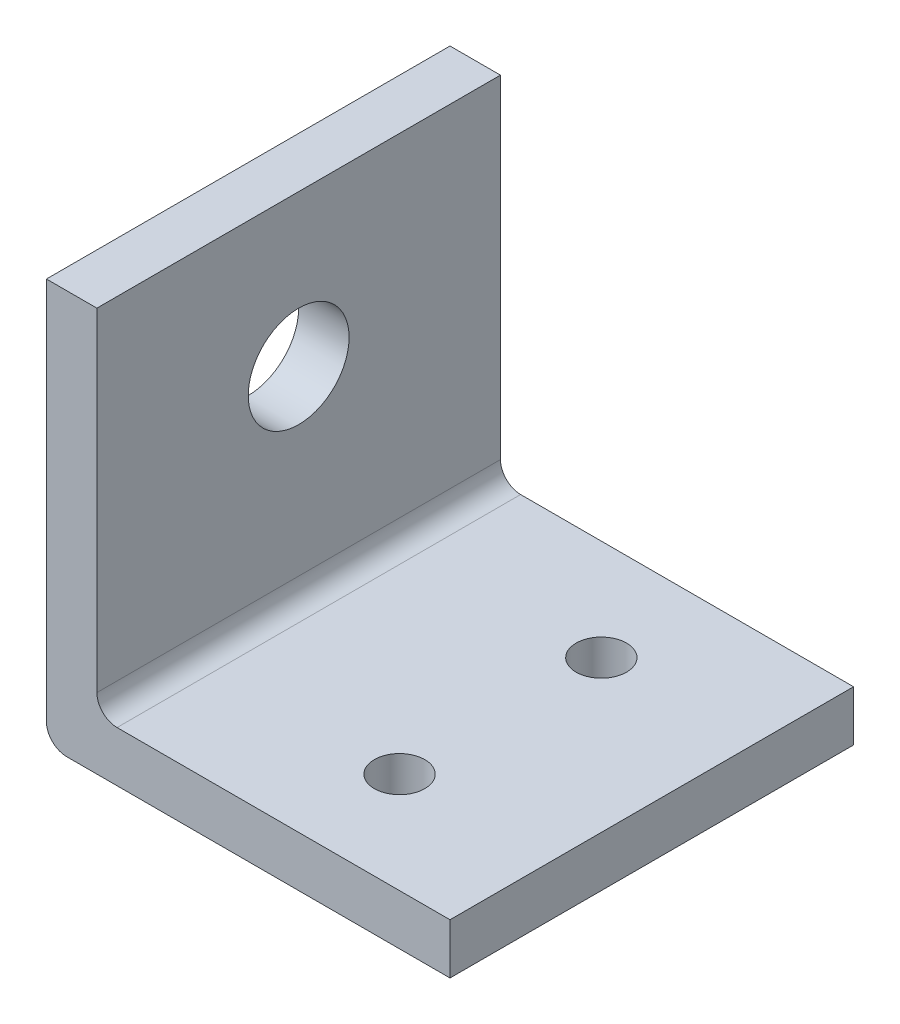
ISO-10303-21;
HEADER;
FILE_DESCRIPTION(('STEP AP214'),'2;1');
FILE_NAME('part.step','',(''),(''),'','','');
FILE_SCHEMA(('AUTOMOTIVE_DESIGN { 1 0 10303 214 1 1 1 1 }'));
ENDSEC;
DATA;
#1=APPLICATION_CONTEXT('core data for automotive mechanical design processes');
#2=APPLICATION_PROTOCOL_DEFINITION('international standard','automotive_design',2000,#1);
#3=PRODUCT_CONTEXT('',#1,'mechanical');
#4=PRODUCT('Part','Part','',(#3));
#5=PRODUCT_RELATED_PRODUCT_CATEGORY('part','',(#4));
#6=PRODUCT_DEFINITION_FORMATION('','',#4);
#7=PRODUCT_DEFINITION_CONTEXT('part definition',#1,'design');
#8=PRODUCT_DEFINITION('design','',#6,#7);
#9=PRODUCT_DEFINITION_SHAPE('','',#8);
#10=(LENGTH_UNIT() NAMED_UNIT(*) SI_UNIT(.MILLI.,.METRE.));
#11=(NAMED_UNIT(*) PLANE_ANGLE_UNIT() SI_UNIT($,.RADIAN.));
#12=(NAMED_UNIT(*) SI_UNIT($,.STERADIAN.) SOLID_ANGLE_UNIT());
#13=UNCERTAINTY_MEASURE_WITH_UNIT(LENGTH_MEASURE(1.E-05),#10,'distance_accuracy_value','');
#14=(GEOMETRIC_REPRESENTATION_CONTEXT(3) GLOBAL_UNCERTAINTY_ASSIGNED_CONTEXT((#13)) GLOBAL_UNIT_ASSIGNED_CONTEXT((#10,
#11,#12)) REPRESENTATION_CONTEXT('',''));
#15=CARTESIAN_POINT('',(0.,0.,0.));
#16=DIRECTION('',(0.,0.,1.));
#17=DIRECTION('',(1.,0.,0.));
#18=AXIS2_PLACEMENT_3D('',#15,#16,#17);
#19=CARTESIAN_POINT('',(0.,40.,40.));
#20=DIRECTION('',(0.,-1.,0.));
#21=DIRECTION('',(0.,0.,-1.));
#22=AXIS2_PLACEMENT_3D('',#19,#20,#21);
#23=PLANE('',#22);
#24=DIRECTION('',(-1.,0.,0.));
#25=VECTOR('',#24,1.);
#26=CARTESIAN_POINT('',(0.,40.,0.));
#27=LINE('',#26,#25);
#28=CARTESIAN_POINT('',(5.,40.,0.));
#29=VERTEX_POINT('',#28);
#30=CARTESIAN_POINT('',(0.,40.,0.));
#31=VERTEX_POINT('',#30);
#32=EDGE_CURVE('E143',#29,#31,#27,.T.);
#33=ORIENTED_EDGE('',*,*,#32,.T.);
#34=DIRECTION('',(0.,0.,-1.));
#35=VECTOR('',#34,1.);
#36=CARTESIAN_POINT('',(0.,40.,40.));
#37=LINE('',#36,#35);
#38=CARTESIAN_POINT('',(0.,40.,40.));
#39=VERTEX_POINT('',#38);
#40=EDGE_CURVE('E11',#39,#31,#37,.T.);
#41=ORIENTED_EDGE('',*,*,#40,.F.);
#42=DIRECTION('',(-1.,0.,0.));
#43=VECTOR('',#42,1.);
#44=CARTESIAN_POINT('',(0.,40.,40.));
#45=LINE('',#44,#43);
#46=CARTESIAN_POINT('',(5.,40.,40.));
#47=VERTEX_POINT('',#46);
#48=EDGE_CURVE('E166',#47,#39,#45,.T.);
#49=ORIENTED_EDGE('',*,*,#48,.F.);
#50=DIRECTION('',(0.,0.,-1.));
#51=VECTOR('',#50,1.);
#52=CARTESIAN_POINT('',(5.,40.,40.));
#53=LINE('',#52,#51);
#54=EDGE_CURVE('E139',#47,#29,#53,.T.);
#55=ORIENTED_EDGE('',*,*,#54,.T.);
#56=EDGE_LOOP('',(#33,#41,#49,#55));
#57=FACE_BOUND('',#56,.T.);
#58=ADVANCED_FACE('F42',(#57),#23,.F.);
#59=CARTESIAN_POINT('',(0.,2.00000000000001,40.));
#60=DIRECTION('',(1.,0.,0.));
#61=DIRECTION('',(0.,0.,-1.));
#62=AXIS2_PLACEMENT_3D('',#59,#60,#61);
#63=PLANE('',#62);
#64=CARTESIAN_POINT('',(0.,25.,20.));
#65=DIRECTION('',(1.,0.,0.));
#66=DIRECTION('',(0.,0.,-1.));
#67=AXIS2_PLACEMENT_3D('',#64,#65,#66);
#68=CIRCLE('',#67,5.);
#69=CARTESIAN_POINT('',(0.,25.,15.));
#70=VERTEX_POINT('',#69);
#71=EDGE_CURVE('E148',#70,#70,#68,.T.);
#72=ORIENTED_EDGE('',*,*,#71,.T.);
#73=EDGE_LOOP('',(#72));
#74=FACE_BOUND('',#73,.T.);
#75=DIRECTION('',(0.,-1.,0.));
#76=VECTOR('',#75,1.);
#77=CARTESIAN_POINT('',(0.,2.00000000000001,0.));
#78=LINE('',#77,#76);
#79=CARTESIAN_POINT('',(0.,2.00000000000001,0.));
#80=VERTEX_POINT('',#79);
#81=EDGE_CURVE('E147',#31,#80,#78,.T.);
#82=ORIENTED_EDGE('',*,*,#81,.T.);
#83=DIRECTION('',(0.,0.,-1.));
#84=VECTOR('',#83,1.);
#85=CARTESIAN_POINT('',(0.,2.00000000000001,40.));
#86=LINE('',#85,#84);
#87=CARTESIAN_POINT('',(0.,2.00000000000001,40.));
#88=VERTEX_POINT('',#87);
#89=EDGE_CURVE('E51',#88,#80,#86,.T.);
#90=ORIENTED_EDGE('',*,*,#89,.F.);
#91=DIRECTION('',(0.,-1.,0.));
#92=VECTOR('',#91,1.);
#93=CARTESIAN_POINT('',(0.,2.00000000000001,40.));
#94=LINE('',#93,#92);
#95=EDGE_CURVE('E102',#39,#88,#94,.T.);
#96=ORIENTED_EDGE('',*,*,#95,.F.);
#97=ORIENTED_EDGE('',*,*,#40,.T.);
#98=EDGE_LOOP('',(#82,#90,#96,#97));
#99=FACE_BOUND('',#98,.T.);
#100=ADVANCED_FACE('F258',(#74,#99),#63,.F.);
#101=CARTESIAN_POINT('',(2.,2.,40.));
#102=DIRECTION('',(0.,0.,-1.));
#103=DIRECTION('',(-1.,0.,0.));
#104=AXIS2_PLACEMENT_3D('',#101,#102,#103);
#105=CYLINDRICAL_SURFACE('',#104,2.);
#106=CARTESIAN_POINT('',(2.,2.,0.));
#107=DIRECTION('',(0.,0.,1.));
#108=DIRECTION('',(-1.,0.,0.));
#109=AXIS2_PLACEMENT_3D('',#106,#107,#108);
#110=CIRCLE('',#109,2.);
#111=CARTESIAN_POINT('',(2.00000000000001,0.,0.));
#112=VERTEX_POINT('',#111);
#113=EDGE_CURVE('E151',#80,#112,#110,.T.);
#114=ORIENTED_EDGE('',*,*,#113,.T.);
#115=DIRECTION('',(0.,0.,-1.));
#116=VECTOR('',#115,1.);
#117=CARTESIAN_POINT('',(2.00000000000001,0.,40.));
#118=LINE('',#117,#116);
#119=CARTESIAN_POINT('',(2.00000000000001,0.,40.));
#120=VERTEX_POINT('',#119);
#121=EDGE_CURVE('E177',#120,#112,#118,.T.);
#122=ORIENTED_EDGE('',*,*,#121,.F.);
#123=CARTESIAN_POINT('',(2.,2.,40.));
#124=DIRECTION('',(0.,0.,1.));
#125=DIRECTION('',(-1.,0.,0.));
#126=AXIS2_PLACEMENT_3D('',#123,#124,#125);
#127=CIRCLE('',#126,2.);
#128=EDGE_CURVE('E187',#88,#120,#127,.T.);
#129=ORIENTED_EDGE('',*,*,#128,.F.);
#130=ORIENTED_EDGE('',*,*,#89,.T.);
#131=EDGE_LOOP('',(#114,#122,#129,#130));
#132=FACE_BOUND('',#131,.T.);
#133=ADVANCED_FACE('F185',(#132),#105,.T.);
#134=CARTESIAN_POINT('',(2.00000000000001,0.,40.));
#135=DIRECTION('',(0.,1.,0.));
#136=DIRECTION('',(0.,0.,1.));
#137=AXIS2_PLACEMENT_3D('',#134,#135,#136);
#138=PLANE('',#137);
#139=CARTESIAN_POINT('',(25.,0.,10.));
#140=DIRECTION('',(0.,1.,0.));
#141=DIRECTION('',(0.,0.,1.));
#142=AXIS2_PLACEMENT_3D('',#139,#140,#141);
#143=CIRCLE('',#142,2.5);
#144=CARTESIAN_POINT('',(25.,0.,12.5));
#145=VERTEX_POINT('',#144);
#146=EDGE_CURVE('E217',#145,#145,#143,.T.);
#147=ORIENTED_EDGE('',*,*,#146,.T.);
#148=EDGE_LOOP('',(#147));
#149=FACE_BOUND('',#148,.T.);
#150=CARTESIAN_POINT('',(25.,0.,30.));
#151=DIRECTION('',(0.,1.,0.));
#152=DIRECTION('',(0.,0.,1.));
#153=AXIS2_PLACEMENT_3D('',#150,#151,#152);
#154=CIRCLE('',#153,2.5);
#155=CARTESIAN_POINT('',(25.,0.,32.5));
#156=VERTEX_POINT('',#155);
#157=EDGE_CURVE('E221',#156,#156,#154,.T.);
#158=ORIENTED_EDGE('',*,*,#157,.T.);
#159=EDGE_LOOP('',(#158));
#160=FACE_BOUND('',#159,.T.);
#161=DIRECTION('',(1.,0.,0.));
#162=VECTOR('',#161,1.);
#163=CARTESIAN_POINT('',(2.00000000000001,0.,0.));
#164=LINE('',#163,#162);
#165=CARTESIAN_POINT('',(40.,0.,0.));
#166=VERTEX_POINT('',#165);
#167=EDGE_CURVE('E154',#112,#166,#164,.T.);
#168=ORIENTED_EDGE('',*,*,#167,.T.);
#169=DIRECTION('',(0.,0.,-1.));
#170=VECTOR('',#169,1.);
#171=CARTESIAN_POINT('',(40.,0.,40.));
#172=LINE('',#171,#170);
#173=CARTESIAN_POINT('',(40.,0.,40.));
#174=VERTEX_POINT('',#173);
#175=EDGE_CURVE('E173',#174,#166,#172,.T.);
#176=ORIENTED_EDGE('',*,*,#175,.F.);
#177=DIRECTION('',(1.,0.,0.));
#178=VECTOR('',#177,1.);
#179=CARTESIAN_POINT('',(2.00000000000001,0.,40.));
#180=LINE('',#179,#178);
#181=EDGE_CURVE('E200',#120,#174,#180,.T.);
#182=ORIENTED_EDGE('',*,*,#181,.F.);
#183=ORIENTED_EDGE('',*,*,#121,.T.);
#184=EDGE_LOOP('',(#168,#176,#182,#183));
#185=FACE_BOUND('',#184,.T.);
#186=ADVANCED_FACE('F195',(#149,#160,#185),#138,.F.);
#187=CARTESIAN_POINT('',(40.,5.,40.));
#188=DIRECTION('',(-1.,0.,0.));
#189=DIRECTION('',(0.,0.,1.));
#190=AXIS2_PLACEMENT_3D('',#187,#188,#189);
#191=PLANE('',#190);
#192=DIRECTION('',(0.,1.,0.));
#193=VECTOR('',#192,1.);
#194=CARTESIAN_POINT('',(40.,5.,0.));
#195=LINE('',#194,#193);
#196=CARTESIAN_POINT('',(40.,5.,0.));
#197=VERTEX_POINT('',#196);
#198=EDGE_CURVE('E157',#166,#197,#195,.T.);
#199=ORIENTED_EDGE('',*,*,#198,.T.);
#200=DIRECTION('',(0.,0.,-1.));
#201=VECTOR('',#200,1.);
#202=CARTESIAN_POINT('',(40.,5.,40.));
#203=LINE('',#202,#201);
#204=CARTESIAN_POINT('',(40.,5.,40.));
#205=VERTEX_POINT('',#204);
#206=EDGE_CURVE('E132',#205,#197,#203,.T.);
#207=ORIENTED_EDGE('',*,*,#206,.F.);
#208=DIRECTION('',(0.,1.,0.));
#209=VECTOR('',#208,1.);
#210=CARTESIAN_POINT('',(40.,5.,40.));
#211=LINE('',#210,#209);
#212=EDGE_CURVE('E121',#174,#205,#211,.T.);
#213=ORIENTED_EDGE('',*,*,#212,.F.);
#214=ORIENTED_EDGE('',*,*,#175,.T.);
#215=EDGE_LOOP('',(#199,#207,#213,#214));
#216=FACE_BOUND('',#215,.T.);
#217=ADVANCED_FACE('F198',(#216),#191,.F.);
#218=CARTESIAN_POINT('',(7.00000000000002,5.,40.));
#219=DIRECTION('',(0.,-1.,0.));
#220=DIRECTION('',(0.,0.,-1.));
#221=AXIS2_PLACEMENT_3D('',#218,#219,#220);
#222=PLANE('',#221);
#223=CARTESIAN_POINT('',(25.,5.,10.));
#224=DIRECTION('',(0.,1.,0.));
#225=DIRECTION('',(0.,0.,1.));
#226=AXIS2_PLACEMENT_3D('',#223,#224,#225);
#227=CIRCLE('',#226,2.5);
#228=CARTESIAN_POINT('',(25.,5.,12.5));
#229=VERTEX_POINT('',#228);
#230=EDGE_CURVE('E225',#229,#229,#227,.T.);
#231=ORIENTED_EDGE('',*,*,#230,.F.);
#232=EDGE_LOOP('',(#231));
#233=FACE_BOUND('',#232,.T.);
#234=CARTESIAN_POINT('',(25.,5.,30.));
#235=DIRECTION('',(0.,1.,0.));
#236=DIRECTION('',(0.,0.,1.));
#237=AXIS2_PLACEMENT_3D('',#234,#235,#236);
#238=CIRCLE('',#237,2.5);
#239=CARTESIAN_POINT('',(25.,5.,32.5));
#240=VERTEX_POINT('',#239);
#241=EDGE_CURVE('E226',#240,#240,#238,.T.);
#242=ORIENTED_EDGE('',*,*,#241,.F.);
#243=EDGE_LOOP('',(#242));
#244=FACE_BOUND('',#243,.T.);
#245=DIRECTION('',(-1.,0.,0.));
#246=VECTOR('',#245,1.);
#247=CARTESIAN_POINT('',(7.00000000000002,5.,0.));
#248=LINE('',#247,#246);
#249=CARTESIAN_POINT('',(7.00000000000002,5.,0.));
#250=VERTEX_POINT('',#249);
#251=EDGE_CURVE('E130',#197,#250,#248,.T.);
#252=ORIENTED_EDGE('',*,*,#251,.T.);
#253=DIRECTION('',(0.,0.,-1.));
#254=VECTOR('',#253,1.);
#255=CARTESIAN_POINT('',(7.00000000000002,5.,40.));
#256=LINE('',#255,#254);
#257=CARTESIAN_POINT('',(7.00000000000002,5.,40.));
#258=VERTEX_POINT('',#257);
#259=EDGE_CURVE('E127',#258,#250,#256,.T.);
#260=ORIENTED_EDGE('',*,*,#259,.F.);
#261=DIRECTION('',(-1.,0.,0.));
#262=VECTOR('',#261,1.);
#263=CARTESIAN_POINT('',(7.00000000000002,5.,40.));
#264=LINE('',#263,#262);
#265=EDGE_CURVE('E115',#205,#258,#264,.T.);
#266=ORIENTED_EDGE('',*,*,#265,.F.);
#267=ORIENTED_EDGE('',*,*,#206,.T.);
#268=EDGE_LOOP('',(#252,#260,#266,#267));
#269=FACE_BOUND('',#268,.T.);
#270=ADVANCED_FACE('F128',(#233,#244,#269),#222,.F.);
#271=CARTESIAN_POINT('',(7.,7.,40.));
#272=DIRECTION('',(0.,0.,-1.));
#273=DIRECTION('',(-1.,0.,0.));
#274=AXIS2_PLACEMENT_3D('',#271,#272,#273);
#275=CYLINDRICAL_SURFACE('',#274,2.);
#276=CARTESIAN_POINT('',(7.,7.,0.));
#277=DIRECTION('',(0.,0.,-1.));
#278=DIRECTION('',(-1.,0.,0.));
#279=AXIS2_PLACEMENT_3D('',#276,#277,#278);
#280=CIRCLE('',#279,2.);
#281=CARTESIAN_POINT('',(5.,7.,0.));
#282=VERTEX_POINT('',#281);
#283=EDGE_CURVE('E88',#250,#282,#280,.T.);
#284=ORIENTED_EDGE('',*,*,#283,.T.);
#285=DIRECTION('',(0.,0.,-1.));
#286=VECTOR('',#285,1.);
#287=CARTESIAN_POINT('',(5.,7.,40.));
#288=LINE('',#287,#286);
#289=CARTESIAN_POINT('',(5.,7.,40.));
#290=VERTEX_POINT('',#289);
#291=EDGE_CURVE('E133',#290,#282,#288,.T.);
#292=ORIENTED_EDGE('',*,*,#291,.F.);
#293=CARTESIAN_POINT('',(7.,7.,40.));
#294=DIRECTION('',(0.,0.,-1.));
#295=DIRECTION('',(-1.,0.,0.));
#296=AXIS2_PLACEMENT_3D('',#293,#294,#295);
#297=CIRCLE('',#296,2.);
#298=EDGE_CURVE('E119',#258,#290,#297,.T.);
#299=ORIENTED_EDGE('',*,*,#298,.F.);
#300=ORIENTED_EDGE('',*,*,#259,.T.);
#301=EDGE_LOOP('',(#284,#292,#299,#300));
#302=FACE_BOUND('',#301,.T.);
#303=ADVANCED_FACE('F135',(#302),#275,.F.);
#304=CARTESIAN_POINT('',(5.,7.00000000000002,40.));
#305=DIRECTION('',(-1.,0.,0.));
#306=DIRECTION('',(0.,0.,1.));
#307=AXIS2_PLACEMENT_3D('',#304,#305,#306);
#308=PLANE('',#307);
#309=CARTESIAN_POINT('',(5.,25.,20.));
#310=DIRECTION('',(1.,0.,0.));
#311=DIRECTION('',(0.,0.,-1.));
#312=AXIS2_PLACEMENT_3D('',#309,#310,#311);
#313=CIRCLE('',#312,5.);
#314=CARTESIAN_POINT('',(5.,25.,15.));
#315=VERTEX_POINT('',#314);
#316=EDGE_CURVE('E213',#315,#315,#313,.T.);
#317=ORIENTED_EDGE('',*,*,#316,.F.);
#318=EDGE_LOOP('',(#317));
#319=FACE_BOUND('',#318,.T.);
#320=DIRECTION('',(0.,1.,0.));
#321=VECTOR('',#320,1.);
#322=CARTESIAN_POINT('',(5.,7.00000000000002,0.));
#323=LINE('',#322,#321);
#324=EDGE_CURVE('E94',#282,#29,#323,.T.);
#325=ORIENTED_EDGE('',*,*,#324,.T.);
#326=ORIENTED_EDGE('',*,*,#54,.F.);
#327=DIRECTION('',(0.,1.,0.));
#328=VECTOR('',#327,1.);
#329=CARTESIAN_POINT('',(5.,7.00000000000002,40.));
#330=LINE('',#329,#328);
#331=EDGE_CURVE('E59',#290,#47,#330,.T.);
#332=ORIENTED_EDGE('',*,*,#331,.F.);
#333=ORIENTED_EDGE('',*,*,#291,.T.);
#334=EDGE_LOOP('',(#325,#326,#332,#333));
#335=FACE_BOUND('',#334,.T.);
#336=ADVANCED_FACE('F268',(#319,#335),#308,.F.);
#337=CARTESIAN_POINT('',(7.,7.,40.));
#338=DIRECTION('',(0.,0.,-1.));
#339=DIRECTION('',(-1.,0.,0.));
#340=AXIS2_PLACEMENT_3D('',#337,#338,#339);
#341=PLANE('',#340);
#342=ORIENTED_EDGE('',*,*,#48,.T.);
#343=ORIENTED_EDGE('',*,*,#95,.T.);
#344=ORIENTED_EDGE('',*,*,#128,.T.);
#345=ORIENTED_EDGE('',*,*,#181,.T.);
#346=ORIENTED_EDGE('',*,*,#212,.T.);
#347=ORIENTED_EDGE('',*,*,#265,.T.);
#348=ORIENTED_EDGE('',*,*,#298,.T.);
#349=ORIENTED_EDGE('',*,*,#331,.T.);
#350=EDGE_LOOP('',(#342,#343,#344,#345,#346,#347,#348,#349));
#351=FACE_BOUND('',#350,.T.);
#352=ADVANCED_FACE('F117',(#351),#341,.F.);
#353=CARTESIAN_POINT('',(7.,7.,0.));
#354=DIRECTION('',(0.,0.,-1.));
#355=DIRECTION('',(-1.,0.,0.));
#356=AXIS2_PLACEMENT_3D('',#353,#354,#355);
#357=PLANE('',#356);
#358=ORIENTED_EDGE('',*,*,#32,.F.);
#359=ORIENTED_EDGE('',*,*,#324,.F.);
#360=ORIENTED_EDGE('',*,*,#283,.F.);
#361=ORIENTED_EDGE('',*,*,#251,.F.);
#362=ORIENTED_EDGE('',*,*,#198,.F.);
#363=ORIENTED_EDGE('',*,*,#167,.F.);
#364=ORIENTED_EDGE('',*,*,#113,.F.);
#365=ORIENTED_EDGE('',*,*,#81,.F.);
#366=EDGE_LOOP('',(#358,#359,#360,#361,#362,#363,#364,#365));
#367=FACE_BOUND('',#366,.T.);
#368=ADVANCED_FACE('F191',(#367),#357,.T.);
#369=CARTESIAN_POINT('',(-35.,25.,20.));
#370=DIRECTION('',(1.,0.,0.));
#371=DIRECTION('',(0.,0.,-1.));
#372=AXIS2_PLACEMENT_3D('',#369,#370,#371);
#373=CYLINDRICAL_SURFACE('',#372,5.);
#374=ORIENTED_EDGE('',*,*,#316,.T.);
#375=EDGE_LOOP('',(#374));
#376=FACE_BOUND('',#375,.T.);
#377=ORIENTED_EDGE('',*,*,#71,.F.);
#378=EDGE_LOOP('',(#377));
#379=FACE_BOUND('',#378,.T.);
#380=ADVANCED_FACE('F245',(#376,#379),#373,.F.);
#381=CARTESIAN_POINT('',(25.,-35.,30.));
#382=DIRECTION('',(0.,1.,0.));
#383=DIRECTION('',(0.,0.,1.));
#384=AXIS2_PLACEMENT_3D('',#381,#382,#383);
#385=CYLINDRICAL_SURFACE('',#384,2.5);
#386=ORIENTED_EDGE('',*,*,#241,.T.);
#387=EDGE_LOOP('',(#386));
#388=FACE_BOUND('',#387,.T.);
#389=ORIENTED_EDGE('',*,*,#157,.F.);
#390=EDGE_LOOP('',(#389));
#391=FACE_BOUND('',#390,.T.);
#392=ADVANCED_FACE('F242',(#388,#391),#385,.F.);
#393=CARTESIAN_POINT('',(25.,-35.,10.));
#394=DIRECTION('',(0.,1.,0.));
#395=DIRECTION('',(0.,0.,1.));
#396=AXIS2_PLACEMENT_3D('',#393,#394,#395);
#397=CYLINDRICAL_SURFACE('',#396,2.5);
#398=ORIENTED_EDGE('',*,*,#230,.T.);
#399=EDGE_LOOP('',(#398));
#400=FACE_BOUND('',#399,.T.);
#401=ORIENTED_EDGE('',*,*,#146,.F.);
#402=EDGE_LOOP('',(#401));
#403=FACE_BOUND('',#402,.T.);
#404=ADVANCED_FACE('F234',(#400,#403),#397,.F.);
#405=CLOSED_SHELL('',(#58,#100,#133,#186,#217,#270,#303,#336,#352,#368,#380,#392,#404));
#406=MANIFOLD_SOLID_BREP('B2',#405);
#407=ADVANCED_BREP_SHAPE_REPRESENTATION('',(#18,#406),#14);
#408=SHAPE_DEFINITION_REPRESENTATION(#9,#407);
ENDSEC;
END-ISO-10303-21;
